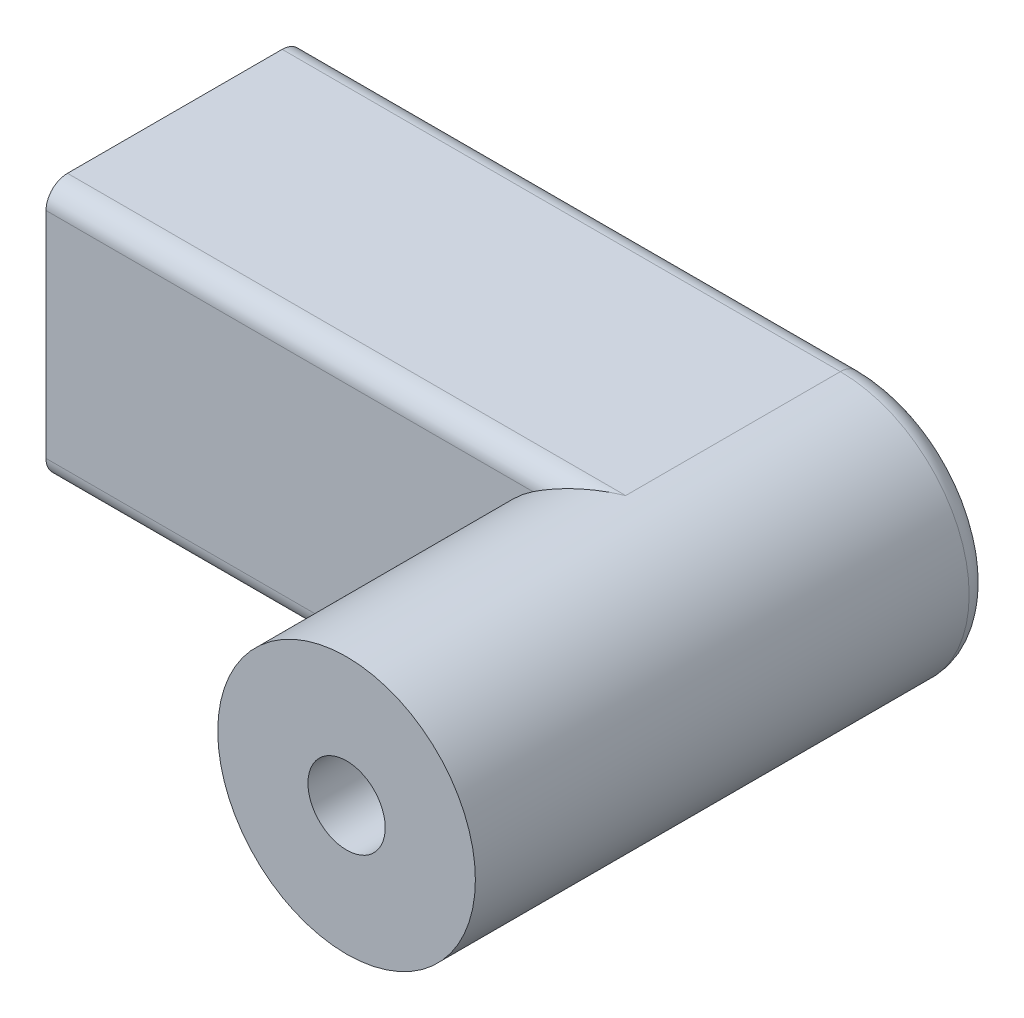
ISO-10303-21;
HEADER;
FILE_DESCRIPTION(('STEP AP214'),'2;1');
FILE_NAME('part.step','',(''),(''),'','','');
FILE_SCHEMA(('AUTOMOTIVE_DESIGN { 1 0 10303 214 1 1 1 1 }'));
ENDSEC;
DATA;
#1=APPLICATION_CONTEXT('core data for automotive mechanical design processes');
#2=APPLICATION_PROTOCOL_DEFINITION('international standard','automotive_design',2000,#1);
#3=PRODUCT_CONTEXT('',#1,'mechanical');
#4=PRODUCT('Part','Part','',(#3));
#5=PRODUCT_RELATED_PRODUCT_CATEGORY('part','',(#4));
#6=PRODUCT_DEFINITION_FORMATION('','',#4);
#7=PRODUCT_DEFINITION_CONTEXT('part definition',#1,'design');
#8=PRODUCT_DEFINITION('design','',#6,#7);
#9=PRODUCT_DEFINITION_SHAPE('','',#8);
#10=(LENGTH_UNIT() NAMED_UNIT(*) SI_UNIT(.MILLI.,.METRE.));
#11=(NAMED_UNIT(*) PLANE_ANGLE_UNIT() SI_UNIT($,.RADIAN.));
#12=(NAMED_UNIT(*) SI_UNIT($,.STERADIAN.) SOLID_ANGLE_UNIT());
#13=UNCERTAINTY_MEASURE_WITH_UNIT(LENGTH_MEASURE(1.E-05),#10,'distance_accuracy_value','');
#14=(GEOMETRIC_REPRESENTATION_CONTEXT(3) GLOBAL_UNCERTAINTY_ASSIGNED_CONTEXT((#13)) GLOBAL_UNIT_ASSIGNED_CONTEXT((#10,
#11,#12)) REPRESENTATION_CONTEXT('',''));
#15=CARTESIAN_POINT('',(0.,0.,0.));
#16=DIRECTION('',(0.,0.,1.));
#17=DIRECTION('',(1.,0.,0.));
#18=AXIS2_PLACEMENT_3D('',#15,#16,#17);
#19=CARTESIAN_POINT('',(0.,0.,6.));
#20=DIRECTION('',(0.,0.,1.));
#21=DIRECTION('',(0.,-1.,0.));
#22=AXIS2_PLACEMENT_3D('',#19,#20,#21);
#23=PLANE('',#22);
#24=CARTESIAN_POINT('',(0.,0.,6.));
#25=DIRECTION('',(0.,0.,1.));
#26=DIRECTION('',(0.,-1.,0.));
#27=AXIS2_PLACEMENT_3D('',#24,#25,#26);
#28=CIRCLE('',#27,3.);
#29=CARTESIAN_POINT('',(0.,-3.,6.));
#30=VERTEX_POINT('',#29);
#31=EDGE_CURVE('E223',#30,#30,#28,.T.);
#32=ORIENTED_EDGE('',*,*,#31,.T.);
#33=EDGE_LOOP('',(#32));
#34=FACE_BOUND('',#33,.T.);
#35=CARTESIAN_POINT('',(0.,0.,6.));
#36=DIRECTION('',(0.,0.,1.));
#37=DIRECTION('',(0.,-1.,0.));
#38=AXIS2_PLACEMENT_3D('',#35,#36,#37);
#39=CIRCLE('',#38,0.9);
#40=CARTESIAN_POINT('',(0.,-0.899999999999999,6.));
#41=VERTEX_POINT('',#40);
#42=EDGE_CURVE('E219',#41,#41,#39,.T.);
#43=ORIENTED_EDGE('',*,*,#42,.F.);
#44=EDGE_LOOP('',(#43));
#45=FACE_BOUND('',#44,.T.);
#46=ADVANCED_FACE('F46',(#34,#45),#23,.T.);
#47=CARTESIAN_POINT('',(0.,0.,-6.));
#48=DIRECTION('',(0.,0.,1.));
#49=DIRECTION('',(0.,-1.,0.));
#50=AXIS2_PLACEMENT_3D('',#47,#48,#49);
#51=PLANE('',#50);
#52=CARTESIAN_POINT('',(0.,0.,-6.));
#53=DIRECTION('',(0.,0.,1.));
#54=DIRECTION('',(0.,-1.,0.));
#55=AXIS2_PLACEMENT_3D('',#52,#53,#54);
#56=CIRCLE('',#55,2.5);
#57=CARTESIAN_POINT('',(0.,2.5,-6.));
#58=VERTEX_POINT('',#57);
#59=CARTESIAN_POINT('',(0.,-2.5,-6.));
#60=VERTEX_POINT('',#59);
#61=EDGE_CURVE('E237',#58,#60,#56,.F.);
#62=ORIENTED_EDGE('',*,*,#61,.T.);
#63=DIRECTION('',(1.,0.,0.));
#64=VECTOR('',#63,1.);
#65=CARTESIAN_POINT('',(0.,-2.5,-6.));
#66=LINE('',#65,#64);
#67=CARTESIAN_POINT('',(-13.,-2.5,-6.));
#68=VERTEX_POINT('',#67);
#69=EDGE_CURVE('E240',#60,#68,#66,.F.);
#70=ORIENTED_EDGE('',*,*,#69,.T.);
#71=DIRECTION('',(0.,-1.,0.));
#72=VECTOR('',#71,1.);
#73=CARTESIAN_POINT('',(-13.,3.,-6.));
#74=LINE('',#73,#72);
#75=CARTESIAN_POINT('',(-13.,2.5,-6.));
#76=VERTEX_POINT('',#75);
#77=EDGE_CURVE('E214',#76,#68,#74,.T.);
#78=ORIENTED_EDGE('',*,*,#77,.F.);
#79=DIRECTION('',(1.,0.,0.));
#80=VECTOR('',#79,1.);
#81=CARTESIAN_POINT('',(0.,2.5,-6.));
#82=LINE('',#81,#80);
#83=EDGE_CURVE('E234',#76,#58,#82,.T.);
#84=ORIENTED_EDGE('',*,*,#83,.T.);
#85=EDGE_LOOP('',(#62,#70,#78,#84));
#86=FACE_BOUND('',#85,.T.);
#87=CARTESIAN_POINT('',(0.,0.,-6.));
#88=DIRECTION('',(0.,0.,1.));
#89=DIRECTION('',(0.,-1.,0.));
#90=AXIS2_PLACEMENT_3D('',#87,#88,#89);
#91=CIRCLE('',#90,0.9);
#92=CARTESIAN_POINT('',(0.,-0.900000000000001,-6.));
#93=VERTEX_POINT('',#92);
#94=EDGE_CURVE('E218',#93,#93,#91,.T.);
#95=ORIENTED_EDGE('',*,*,#94,.T.);
#96=EDGE_LOOP('',(#95));
#97=FACE_BOUND('',#96,.T.);
#98=ADVANCED_FACE('F300',(#86,#97),#51,.F.);
#99=CARTESIAN_POINT('',(0.,0.,6.));
#100=DIRECTION('',(0.,0.,-1.));
#101=DIRECTION('',(0.,1.,0.));
#102=AXIS2_PLACEMENT_3D('',#99,#100,#101);
#103=CYLINDRICAL_SURFACE('',#102,3.);
#104=ORIENTED_EDGE('',*,*,#31,.F.);
#105=EDGE_LOOP('',(#104));
#106=FACE_BOUND('',#105,.T.);
#107=DIRECTION('',(0.,0.,-1.));
#108=VECTOR('',#107,1.);
#109=CARTESIAN_POINT('',(0.,-3.,6.));
#110=LINE('',#109,#108);
#111=CARTESIAN_POINT('',(0.,-3.,-5.5));
#112=VERTEX_POINT('',#111);
#113=CARTESIAN_POINT('',(0.,-3.,-0.5));
#114=VERTEX_POINT('',#113);
#115=EDGE_CURVE('E194',#112,#114,#110,.F.);
#116=ORIENTED_EDGE('',*,*,#115,.F.);
#117=CARTESIAN_POINT('',(0.,0.,-5.5));
#118=DIRECTION('',(0.,0.,1.));
#119=DIRECTION('',(0.,-1.,0.));
#120=AXIS2_PLACEMENT_3D('',#117,#118,#119);
#121=CIRCLE('',#120,3.);
#122=CARTESIAN_POINT('',(0.,3.,-5.5));
#123=VERTEX_POINT('',#122);
#124=EDGE_CURVE('E230',#112,#123,#121,.T.);
#125=ORIENTED_EDGE('',*,*,#124,.T.);
#126=DIRECTION('',(0.,0.,-1.));
#127=VECTOR('',#126,1.);
#128=CARTESIAN_POINT('',(0.,3.,6.));
#129=LINE('',#128,#127);
#130=CARTESIAN_POINT('',(0.,3.,-0.5));
#131=VERTEX_POINT('',#130);
#132=EDGE_CURVE('E184',#123,#131,#129,.F.);
#133=ORIENTED_EDGE('',*,*,#132,.T.);
#134=CARTESIAN_POINT('',(-1.6583123951777,2.5,0.));
#135=CARTESIAN_POINT('',(-1.62294442389626,2.5234654934639,-1.95507206975599E-05));
#136=CARTESIAN_POINT('',(-1.58710499265372,2.54615299134875,-0.00164994916894755));
#137=CARTESIAN_POINT('',(-1.51472138396971,2.58986425514904,-0.00764358737440156));
#138=CARTESIAN_POINT('',(-1.47817843136526,2.61089063561975,-0.0120024320587876));
#139=CARTESIAN_POINT('',(-1.40470504629449,2.65114156465537,-0.022938424672973));
#140=CARTESIAN_POINT('',(-1.36777766630945,2.67037501582419,-0.0295037741057903));
#141=CARTESIAN_POINT('',(-1.29344685593278,2.70716011125678,-0.0445009621293465));
#142=CARTESIAN_POINT('',(-1.25604315650892,2.72471075255046,-0.052933904034741));
#143=CARTESIAN_POINT('',(-1.15052852760255,2.77160739186769,-0.078788001109604));
#144=CARTESIAN_POINT('',(-1.08199171317208,2.7990447861906,-0.0979713651124975));
#145=CARTESIAN_POINT('',(-0.944114314919654,2.84851170917893,-0.140011190340652));
#146=CARTESIAN_POINT('',(-0.874773364195539,2.87053865868494,-0.162869394805722));
#147=CARTESIAN_POINT('',(-0.665524946967841,2.92883784949406,-0.235486162195037));
#148=CARTESIAN_POINT('',(-0.524727164761933,2.9571819210025,-0.289194181711027));
#149=CARTESIAN_POINT('',(-0.259249953486023,2.9914036055076,-0.394205237294453));
#150=CARTESIAN_POINT('',(-0.13465626591283,2.99956232429863,-0.445027957113722));
#151=CARTESIAN_POINT('',(-0.00676117999003824,2.99999427491286,-0.497239759046843));
#152=CARTESIAN_POINT('',(-0.00338055702080258,2.99999998838658,-0.498619892704301));
#153=CARTESIAN_POINT('',(0.,3.,-0.5));
#154=B_SPLINE_CURVE_WITH_KNOTS('',3,(#134,#135,#136,#137,#138,#139,#140,#141,#142,#143,#144,
#145,#146,#147,#148,#149,#150,#151,#152,#153),.UNSPECIFIED.,.F.,.F.,(4,2,2,2,2,2,2,2,2,4),(0.,
0.127240004662348,0.254275572444974,0.380642393218094,0.507084067611572,0.73554595909279,
0.964116547928085,1.42237712040049,1.8258427134639,1.83679717802781),.UNSPECIFIED.);
#155=CARTESIAN_POINT('',(-1.6583123951777,2.5,0.));
#156=VERTEX_POINT('',#155);
#157=EDGE_CURVE('E275',#131,#156,#154,.F.);
#158=ORIENTED_EDGE('',*,*,#157,.T.);
#159=CARTESIAN_POINT('',(0.,0.,0.));
#160=DIRECTION('',(0.,0.,1.));
#161=DIRECTION('',(0.,-1.,0.));
#162=AXIS2_PLACEMENT_3D('',#159,#160,#161);
#163=CIRCLE('',#162,3.);
#164=CARTESIAN_POINT('',(-1.6583123951777,-2.5,0.));
#165=VERTEX_POINT('',#164);
#166=EDGE_CURVE('E195',#165,#156,#163,.F.);
#167=ORIENTED_EDGE('',*,*,#166,.F.);
#168=CARTESIAN_POINT('',(-1.6583123951777,-2.5,0.));
#169=CARTESIAN_POINT('',(-1.62294442389626,-2.5234654934639,-1.95507206975862E-05));
#170=CARTESIAN_POINT('',(-1.58710499265371,-2.54615299134875,-0.0016499491689479));
#171=CARTESIAN_POINT('',(-1.51472138396969,-2.58986425514904,-0.00764358737440296));
#172=CARTESIAN_POINT('',(-1.47817843136524,-2.61089063561976,-0.0120024320587897));
#173=CARTESIAN_POINT('',(-1.40470504629447,-2.65114156465538,-0.0229384246729759));
#174=CARTESIAN_POINT('',(-1.36777766630944,-2.6703750158242,-0.0295037741057929));
#175=CARTESIAN_POINT('',(-1.29344685593278,-2.70716011125679,-0.0445009621293478));
#176=CARTESIAN_POINT('',(-1.25604315650892,-2.72471075255047,-0.0529339040347412));
#177=CARTESIAN_POINT('',(-1.15052852760255,-2.77160739186769,-0.0787880011096044));
#178=CARTESIAN_POINT('',(-1.08199171317208,-2.7990447861906,-0.0979713651125009));
#179=CARTESIAN_POINT('',(-0.944114314919657,-2.84851170917893,-0.140011190340647));
#180=CARTESIAN_POINT('',(-0.874773364195541,-2.87053865868494,-0.162869394805705));
#181=CARTESIAN_POINT('',(-0.665524946967859,-2.92883784949406,-0.235486162195067));
#182=CARTESIAN_POINT('',(-0.524727164762002,-2.9571819210025,-0.289194181711196));
#183=CARTESIAN_POINT('',(-0.259249953485957,-2.99140360550761,-0.394205237294302));
#184=CARTESIAN_POINT('',(-0.134656265912607,-2.99956232429863,-0.445027957113182));
#185=CARTESIAN_POINT('',(-0.00676117999002619,-2.99999427491286,-0.497239759046814));
#186=CARTESIAN_POINT('',(-0.00338055702079642,-2.99999998838658,-0.498619892704286));
#187=CARTESIAN_POINT('',(0.,-3.,-0.5));
#188=B_SPLINE_CURVE_WITH_KNOTS('',3,(#168,#169,#170,#171,#172,#173,#174,#175,#176,#177,#178,
#179,#180,#181,#182,#183,#184,#185,#186,#187),.UNSPECIFIED.,.F.,.F.,(4,2,2,2,2,2,2,2,2,4),(0.,
0.127240004662359,0.254275572444993,0.380642393218104,0.507084067611572,0.735545959092786,
0.964116547928073,1.42237712040049,1.8258427134639,1.83679717802781),.UNSPECIFIED.);
#189=EDGE_CURVE('E284',#165,#114,#188,.T.);
#190=ORIENTED_EDGE('',*,*,#189,.T.);
#191=EDGE_LOOP('',(#116,#125,#133,#158,#167,#190));
#192=FACE_BOUND('',#191,.T.);
#193=ADVANCED_FACE('F294',(#106,#192),#103,.T.);
#194=CARTESIAN_POINT('',(0.,0.,6.));
#195=DIRECTION('',(0.,0.,-1.));
#196=DIRECTION('',(0.,1.,0.));
#197=AXIS2_PLACEMENT_3D('',#194,#195,#196);
#198=CYLINDRICAL_SURFACE('',#197,0.9);
#199=ORIENTED_EDGE('',*,*,#42,.T.);
#200=EDGE_LOOP('',(#199));
#201=FACE_BOUND('',#200,.T.);
#202=ORIENTED_EDGE('',*,*,#94,.F.);
#203=EDGE_LOOP('',(#202));
#204=FACE_BOUND('',#203,.T.);
#205=ADVANCED_FACE('F299',(#201,#204),#198,.F.);
#206=CARTESIAN_POINT('',(-13.,-3.,-6.));
#207=DIRECTION('',(0.,1.,0.));
#208=DIRECTION('',(-1.,0.,0.));
#209=AXIS2_PLACEMENT_3D('',#206,#207,#208);
#210=PLANE('',#209);
#211=DIRECTION('',(0.,0.,1.));
#212=VECTOR('',#211,1.);
#213=CARTESIAN_POINT('',(-13.,-3.,-6.));
#214=LINE('',#213,#212);
#215=CARTESIAN_POINT('',(-13.,-3.,-5.5));
#216=VERTEX_POINT('',#215);
#217=CARTESIAN_POINT('',(-13.,-3.,-0.5));
#218=VERTEX_POINT('',#217);
#219=EDGE_CURVE('E199',#216,#218,#214,.T.);
#220=ORIENTED_EDGE('',*,*,#219,.F.);
#221=DIRECTION('',(1.,0.,0.));
#222=VECTOR('',#221,1.);
#223=CARTESIAN_POINT('',(-13.,-3.,-5.5));
#224=LINE('',#223,#222);
#225=EDGE_CURVE('E246',#216,#112,#224,.T.);
#226=ORIENTED_EDGE('',*,*,#225,.T.);
#227=ORIENTED_EDGE('',*,*,#115,.T.);
#228=DIRECTION('',(1.,0.,0.));
#229=VECTOR('',#228,1.);
#230=CARTESIAN_POINT('',(-13.,-3.,-0.5));
#231=LINE('',#230,#229);
#232=EDGE_CURVE('E243',#114,#218,#231,.F.);
#233=ORIENTED_EDGE('',*,*,#232,.T.);
#234=EDGE_LOOP('',(#220,#226,#227,#233));
#235=FACE_BOUND('',#234,.T.);
#236=ADVANCED_FACE('F329',(#235),#210,.F.);
#237=CARTESIAN_POINT('',(-13.,3.,0.));
#238=DIRECTION('',(0.,0.,-1.));
#239=DIRECTION('',(0.,1.,0.));
#240=AXIS2_PLACEMENT_3D('',#237,#238,#239);
#241=PLANE('',#240);
#242=ORIENTED_EDGE('',*,*,#166,.T.);
#243=DIRECTION('',(1.,0.,0.));
#244=VECTOR('',#243,1.);
#245=CARTESIAN_POINT('',(-13.,2.5,0.));
#246=LINE('',#245,#244);
#247=CARTESIAN_POINT('',(-13.,2.5,0.));
#248=VERTEX_POINT('',#247);
#249=EDGE_CURVE('E272',#156,#248,#246,.F.);
#250=ORIENTED_EDGE('',*,*,#249,.T.);
#251=DIRECTION('',(0.,1.,0.));
#252=VECTOR('',#251,1.);
#253=CARTESIAN_POINT('',(-13.,3.,0.));
#254=LINE('',#253,#252);
#255=CARTESIAN_POINT('',(-13.,-2.5,0.));
#256=VERTEX_POINT('',#255);
#257=EDGE_CURVE('E206',#256,#248,#254,.T.);
#258=ORIENTED_EDGE('',*,*,#257,.F.);
#259=DIRECTION('',(1.,0.,0.));
#260=VECTOR('',#259,1.);
#261=CARTESIAN_POINT('',(-13.,-2.5,0.));
#262=LINE('',#261,#260);
#263=EDGE_CURVE('E268',#256,#165,#262,.T.);
#264=ORIENTED_EDGE('',*,*,#263,.T.);
#265=EDGE_LOOP('',(#242,#250,#258,#264));
#266=FACE_BOUND('',#265,.T.);
#267=ADVANCED_FACE('F333',(#266),#241,.F.);
#268=CARTESIAN_POINT('',(-13.,3.,-6.));
#269=DIRECTION('',(0.,-1.,0.));
#270=DIRECTION('',(1.,0.,0.));
#271=AXIS2_PLACEMENT_3D('',#268,#269,#270);
#272=PLANE('',#271);
#273=ORIENTED_EDGE('',*,*,#132,.F.);
#274=DIRECTION('',(1.,0.,0.));
#275=VECTOR('',#274,1.);
#276=CARTESIAN_POINT('',(-13.,3.,-5.5));
#277=LINE('',#276,#275);
#278=CARTESIAN_POINT('',(-13.,3.,-5.5));
#279=VERTEX_POINT('',#278);
#280=EDGE_CURVE('E265',#123,#279,#277,.F.);
#281=ORIENTED_EDGE('',*,*,#280,.T.);
#282=DIRECTION('',(0.,0.,-1.));
#283=VECTOR('',#282,1.);
#284=CARTESIAN_POINT('',(-13.,3.,-6.));
#285=LINE('',#284,#283);
#286=CARTESIAN_POINT('',(-13.,3.,-0.5));
#287=VERTEX_POINT('',#286);
#288=EDGE_CURVE('E210',#287,#279,#285,.T.);
#289=ORIENTED_EDGE('',*,*,#288,.F.);
#290=DIRECTION('',(1.,0.,0.));
#291=VECTOR('',#290,1.);
#292=CARTESIAN_POINT('',(-13.,3.,-0.5));
#293=LINE('',#292,#291);
#294=EDGE_CURVE('E261',#287,#131,#293,.T.);
#295=ORIENTED_EDGE('',*,*,#294,.T.);
#296=EDGE_LOOP('',(#273,#281,#289,#295));
#297=FACE_BOUND('',#296,.T.);
#298=ADVANCED_FACE('F337',(#297),#272,.F.);
#299=CARTESIAN_POINT('',(-13.,0.,-6.));
#300=DIRECTION('',(1.,0.,0.));
#301=DIRECTION('',(0.,1.,0.));
#302=AXIS2_PLACEMENT_3D('',#299,#300,#301);
#303=PLANE('',#302);
#304=DIRECTION('',(0.,0.,-1.));
#305=VECTOR('',#304,1.);
#306=CARTESIAN_POINT('',(-13.,-2.1,-6.));
#307=LINE('',#306,#305);
#308=CARTESIAN_POINT('',(-13.,-2.1,-0.9));
#309=VERTEX_POINT('',#308);
#310=CARTESIAN_POINT('',(-13.,-2.1,-5.1));
#311=VERTEX_POINT('',#310);
#312=EDGE_CURVE('E388',#309,#311,#307,.T.);
#313=ORIENTED_EDGE('',*,*,#312,.T.);
#314=DIRECTION('',(0.,1.,0.));
#315=VECTOR('',#314,1.);
#316=CARTESIAN_POINT('',(-13.,0.,-5.1));
#317=LINE('',#316,#315);
#318=CARTESIAN_POINT('',(-13.,2.1,-5.1));
#319=VERTEX_POINT('',#318);
#320=EDGE_CURVE('E391',#311,#319,#317,.T.);
#321=ORIENTED_EDGE('',*,*,#320,.T.);
#322=DIRECTION('',(0.,0.,1.));
#323=VECTOR('',#322,1.);
#324=CARTESIAN_POINT('',(-13.,2.1,-6.));
#325=LINE('',#324,#323);
#326=CARTESIAN_POINT('',(-13.,2.1,-0.9));
#327=VERTEX_POINT('',#326);
#328=EDGE_CURVE('E369',#319,#327,#325,.T.);
#329=ORIENTED_EDGE('',*,*,#328,.T.);
#330=DIRECTION('',(0.,-1.,0.));
#331=VECTOR('',#330,1.);
#332=CARTESIAN_POINT('',(-13.,0.,-0.9));
#333=LINE('',#332,#331);
#334=EDGE_CURVE('E383',#327,#309,#333,.T.);
#335=ORIENTED_EDGE('',*,*,#334,.T.);
#336=EDGE_LOOP('',(#313,#321,#329,#335));
#337=FACE_BOUND('',#336,.T.);
#338=ORIENTED_EDGE('',*,*,#77,.T.);
#339=CARTESIAN_POINT('',(-13.,-2.5,-5.5));
#340=DIRECTION('',(1.,0.,0.));
#341=DIRECTION('',(0.,1.,0.));
#342=AXIS2_PLACEMENT_3D('',#339,#340,#341);
#343=CIRCLE('',#342,0.5);
#344=EDGE_CURVE('E258',#68,#216,#343,.F.);
#345=ORIENTED_EDGE('',*,*,#344,.T.);
#346=ORIENTED_EDGE('',*,*,#219,.T.);
#347=CARTESIAN_POINT('',(-13.,-2.5,-0.5));
#348=DIRECTION('',(1.,0.,0.));
#349=DIRECTION('',(0.,1.,0.));
#350=AXIS2_PLACEMENT_3D('',#347,#348,#349);
#351=CIRCLE('',#350,0.5);
#352=EDGE_CURVE('E249',#218,#256,#351,.F.);
#353=ORIENTED_EDGE('',*,*,#352,.T.);
#354=ORIENTED_EDGE('',*,*,#257,.T.);
#355=CARTESIAN_POINT('',(-13.,2.5,-0.5));
#356=DIRECTION('',(1.,0.,0.));
#357=DIRECTION('',(0.,1.,0.));
#358=AXIS2_PLACEMENT_3D('',#355,#356,#357);
#359=CIRCLE('',#358,0.5);
#360=EDGE_CURVE('E252',#248,#287,#359,.F.);
#361=ORIENTED_EDGE('',*,*,#360,.T.);
#362=ORIENTED_EDGE('',*,*,#288,.T.);
#363=CARTESIAN_POINT('',(-13.,2.5,-5.5));
#364=DIRECTION('',(1.,0.,0.));
#365=DIRECTION('',(0.,1.,0.));
#366=AXIS2_PLACEMENT_3D('',#363,#364,#365);
#367=CIRCLE('',#366,0.5);
#368=EDGE_CURVE('E255',#279,#76,#367,.F.);
#369=ORIENTED_EDGE('',*,*,#368,.T.);
#370=EDGE_LOOP('',(#338,#345,#346,#353,#354,#361,#362,#369));
#371=FACE_BOUND('',#370,.T.);
#372=ADVANCED_FACE('F341',(#337,#371),#303,.F.);
#373=CARTESIAN_POINT('',(-3.,-1.6,-4.6));
#374=DIRECTION('',(0.,-1.,0.));
#375=DIRECTION('',(1.,0.,0.));
#376=AXIS2_PLACEMENT_3D('',#373,#374,#375);
#377=PLANE('',#376);
#378=DIRECTION('',(-1.,0.,0.));
#379=VECTOR('',#378,1.);
#380=CARTESIAN_POINT('',(-3.,-1.6,-4.6));
#381=LINE('',#380,#379);
#382=CARTESIAN_POINT('',(-3.,-1.6,-4.6));
#383=VERTEX_POINT('',#382);
#384=CARTESIAN_POINT('',(-12.5,-1.6,-4.6));
#385=VERTEX_POINT('',#384);
#386=EDGE_CURVE('E181',#383,#385,#381,.T.);
#387=ORIENTED_EDGE('',*,*,#386,.T.);
#388=DIRECTION('',(0.,0.,1.));
#389=VECTOR('',#388,1.);
#390=CARTESIAN_POINT('',(-12.5,-1.6,-4.6));
#391=LINE('',#390,#389);
#392=CARTESIAN_POINT('',(-12.5,-1.6,-1.4));
#393=VERTEX_POINT('',#392);
#394=EDGE_CURVE('E72',#385,#393,#391,.T.);
#395=ORIENTED_EDGE('',*,*,#394,.T.);
#396=DIRECTION('',(-1.,0.,0.));
#397=VECTOR('',#396,1.);
#398=CARTESIAN_POINT('',(-3.,-1.6,-1.4));
#399=LINE('',#398,#397);
#400=CARTESIAN_POINT('',(-3.,-1.6,-1.4));
#401=VERTEX_POINT('',#400);
#402=EDGE_CURVE('E148',#401,#393,#399,.T.);
#403=ORIENTED_EDGE('',*,*,#402,.F.);
#404=DIRECTION('',(0.,0.,1.));
#405=VECTOR('',#404,1.);
#406=CARTESIAN_POINT('',(-3.,-1.6,-4.6));
#407=LINE('',#406,#405);
#408=EDGE_CURVE('E152',#383,#401,#407,.T.);
#409=ORIENTED_EDGE('',*,*,#408,.F.);
#410=EDGE_LOOP('',(#387,#395,#403,#409));
#411=FACE_BOUND('',#410,.T.);
#412=ADVANCED_FACE('F150',(#411),#377,.F.);
#413=CARTESIAN_POINT('',(-3.,1.6,-4.6));
#414=DIRECTION('',(0.,0.,-1.));
#415=DIRECTION('',(0.,1.,0.));
#416=AXIS2_PLACEMENT_3D('',#413,#414,#415);
#417=PLANE('',#416);
#418=DIRECTION('',(-1.,0.,0.));
#419=VECTOR('',#418,1.);
#420=CARTESIAN_POINT('',(-3.,1.6,-4.6));
#421=LINE('',#420,#419);
#422=CARTESIAN_POINT('',(-3.,1.6,-4.6));
#423=VERTEX_POINT('',#422);
#424=CARTESIAN_POINT('',(-12.5,1.6,-4.6));
#425=VERTEX_POINT('',#424);
#426=EDGE_CURVE('E185',#423,#425,#421,.T.);
#427=ORIENTED_EDGE('',*,*,#426,.T.);
#428=DIRECTION('',(0.,-1.,0.));
#429=VECTOR('',#428,1.);
#430=CARTESIAN_POINT('',(-12.5,1.6,-4.6));
#431=LINE('',#430,#429);
#432=EDGE_CURVE('E362',#425,#385,#431,.T.);
#433=ORIENTED_EDGE('',*,*,#432,.T.);
#434=ORIENTED_EDGE('',*,*,#386,.F.);
#435=DIRECTION('',(0.,-1.,0.));
#436=VECTOR('',#435,1.);
#437=CARTESIAN_POINT('',(-3.,1.6,-4.6));
#438=LINE('',#437,#436);
#439=EDGE_CURVE('E156',#423,#383,#438,.T.);
#440=ORIENTED_EDGE('',*,*,#439,.F.);
#441=EDGE_LOOP('',(#427,#433,#434,#440));
#442=FACE_BOUND('',#441,.T.);
#443=ADVANCED_FACE('F348',(#442),#417,.F.);
#444=CARTESIAN_POINT('',(-3.,1.6,-4.6));
#445=DIRECTION('',(0.,1.,0.));
#446=DIRECTION('',(-1.,0.,0.));
#447=AXIS2_PLACEMENT_3D('',#444,#445,#446);
#448=PLANE('',#447);
#449=DIRECTION('',(-1.,0.,0.));
#450=VECTOR('',#449,1.);
#451=CARTESIAN_POINT('',(-3.,1.6,-1.4));
#452=LINE('',#451,#450);
#453=CARTESIAN_POINT('',(-3.,1.6,-1.4));
#454=VERTEX_POINT('',#453);
#455=CARTESIAN_POINT('',(-12.5,1.6,-1.4));
#456=VERTEX_POINT('',#455);
#457=EDGE_CURVE('E155',#454,#456,#452,.T.);
#458=ORIENTED_EDGE('',*,*,#457,.T.);
#459=DIRECTION('',(0.,0.,-1.));
#460=VECTOR('',#459,1.);
#461=CARTESIAN_POINT('',(-12.5,1.6,-4.6));
#462=LINE('',#461,#460);
#463=EDGE_CURVE('E11',#456,#425,#462,.T.);
#464=ORIENTED_EDGE('',*,*,#463,.T.);
#465=ORIENTED_EDGE('',*,*,#426,.F.);
#466=DIRECTION('',(0.,0.,-1.));
#467=VECTOR('',#466,1.);
#468=CARTESIAN_POINT('',(-3.,1.6,-4.6));
#469=LINE('',#468,#467);
#470=EDGE_CURVE('E165',#454,#423,#469,.T.);
#471=ORIENTED_EDGE('',*,*,#470,.F.);
#472=EDGE_LOOP('',(#458,#464,#465,#471));
#473=FACE_BOUND('',#472,.T.);
#474=ADVANCED_FACE('F351',(#473),#448,.F.);
#475=CARTESIAN_POINT('',(-3.,1.6,-1.4));
#476=DIRECTION('',(0.,0.,1.));
#477=DIRECTION('',(0.,-1.,0.));
#478=AXIS2_PLACEMENT_3D('',#475,#476,#477);
#479=PLANE('',#478);
#480=ORIENTED_EDGE('',*,*,#402,.T.);
#481=DIRECTION('',(0.,1.,0.));
#482=VECTOR('',#481,1.);
#483=CARTESIAN_POINT('',(-12.5,1.6,-1.4));
#484=LINE('',#483,#482);
#485=EDGE_CURVE('E57',#393,#456,#484,.T.);
#486=ORIENTED_EDGE('',*,*,#485,.T.);
#487=ORIENTED_EDGE('',*,*,#457,.F.);
#488=DIRECTION('',(0.,1.,0.));
#489=VECTOR('',#488,1.);
#490=CARTESIAN_POINT('',(-3.,1.6,-1.4));
#491=LINE('',#490,#489);
#492=EDGE_CURVE('E159',#401,#454,#491,.T.);
#493=ORIENTED_EDGE('',*,*,#492,.F.);
#494=EDGE_LOOP('',(#480,#486,#487,#493));
#495=FACE_BOUND('',#494,.T.);
#496=ADVANCED_FACE('F160',(#495),#479,.F.);
#497=CARTESIAN_POINT('',(-3.,0.,-6.));
#498=DIRECTION('',(1.,0.,0.));
#499=DIRECTION('',(0.,1.,0.));
#500=AXIS2_PLACEMENT_3D('',#497,#498,#499);
#501=PLANE('',#500);
#502=ORIENTED_EDGE('',*,*,#408,.T.);
#503=ORIENTED_EDGE('',*,*,#492,.T.);
#504=ORIENTED_EDGE('',*,*,#470,.T.);
#505=ORIENTED_EDGE('',*,*,#439,.T.);
#506=EDGE_LOOP('',(#502,#503,#504,#505));
#507=FACE_BOUND('',#506,.T.);
#508=ADVANCED_FACE('F167',(#507),#501,.F.);
#509=CARTESIAN_POINT('',(-13.,-2.5,-5.5));
#510=DIRECTION('',(1.,0.,0.));
#511=DIRECTION('',(0.,1.,0.));
#512=AXIS2_PLACEMENT_3D('',#509,#510,#511);
#513=CYLINDRICAL_SURFACE('',#512,0.5);
#514=ORIENTED_EDGE('',*,*,#344,.F.);
#515=ORIENTED_EDGE('',*,*,#69,.F.);
#516=CARTESIAN_POINT('',(0.,-2.5,-5.5));
#517=DIRECTION('',(1.,0.,0.));
#518=DIRECTION('',(0.,1.,0.));
#519=AXIS2_PLACEMENT_3D('',#516,#517,#518);
#520=CIRCLE('',#519,0.5);
#521=EDGE_CURVE('E170',#112,#60,#520,.T.);
#522=ORIENTED_EDGE('',*,*,#521,.F.);
#523=ORIENTED_EDGE('',*,*,#225,.F.);
#524=EDGE_LOOP('',(#514,#515,#522,#523));
#525=FACE_BOUND('',#524,.T.);
#526=ADVANCED_FACE('F310',(#525),#513,.T.);
#527=CARTESIAN_POINT('',(0.,2.5,-5.5));
#528=DIRECTION('',(1.,0.,0.));
#529=DIRECTION('',(0.,1.,0.));
#530=AXIS2_PLACEMENT_3D('',#527,#528,#529);
#531=CYLINDRICAL_SURFACE('',#530,0.5);
#532=ORIENTED_EDGE('',*,*,#368,.F.);
#533=ORIENTED_EDGE('',*,*,#280,.F.);
#534=CARTESIAN_POINT('',(0.,2.5,-5.5));
#535=DIRECTION('',(1.,0.,0.));
#536=DIRECTION('',(0.,1.,0.));
#537=AXIS2_PLACEMENT_3D('',#534,#535,#536);
#538=CIRCLE('',#537,0.5);
#539=EDGE_CURVE('E174',#58,#123,#538,.T.);
#540=ORIENTED_EDGE('',*,*,#539,.F.);
#541=ORIENTED_EDGE('',*,*,#83,.F.);
#542=EDGE_LOOP('',(#532,#533,#540,#541));
#543=FACE_BOUND('',#542,.T.);
#544=ADVANCED_FACE('F307',(#543),#531,.T.);
#545=CARTESIAN_POINT('',(0.,0.,-5.5));
#546=DIRECTION('',(0.,0.,1.));
#547=DIRECTION('',(0.,-1.,0.));
#548=AXIS2_PLACEMENT_3D('',#545,#546,#547);
#549=TOROIDAL_SURFACE('',#548,2.5,0.5);
#550=ORIENTED_EDGE('',*,*,#521,.T.);
#551=ORIENTED_EDGE('',*,*,#61,.F.);
#552=ORIENTED_EDGE('',*,*,#539,.T.);
#553=ORIENTED_EDGE('',*,*,#124,.F.);
#554=EDGE_LOOP('',(#550,#551,#552,#553));
#555=FACE_BOUND('',#554,.T.);
#556=ADVANCED_FACE('F303',(#555),#549,.T.);
#557=CARTESIAN_POINT('',(-13.,2.5,-0.5));
#558=DIRECTION('',(1.,0.,0.));
#559=DIRECTION('',(0.,1.,0.));
#560=AXIS2_PLACEMENT_3D('',#557,#558,#559);
#561=CYLINDRICAL_SURFACE('',#560,0.5);
#562=ORIENTED_EDGE('',*,*,#360,.F.);
#563=ORIENTED_EDGE('',*,*,#249,.F.);
#564=ORIENTED_EDGE('',*,*,#157,.F.);
#565=ORIENTED_EDGE('',*,*,#294,.F.);
#566=EDGE_LOOP('',(#562,#563,#564,#565));
#567=FACE_BOUND('',#566,.T.);
#568=ADVANCED_FACE('F291',(#567),#561,.T.);
#569=CARTESIAN_POINT('',(-13.,-2.5,-0.5));
#570=DIRECTION('',(1.,0.,0.));
#571=DIRECTION('',(0.,1.,0.));
#572=AXIS2_PLACEMENT_3D('',#569,#570,#571);
#573=CYLINDRICAL_SURFACE('',#572,0.5);
#574=ORIENTED_EDGE('',*,*,#352,.F.);
#575=ORIENTED_EDGE('',*,*,#232,.F.);
#576=ORIENTED_EDGE('',*,*,#189,.F.);
#577=ORIENTED_EDGE('',*,*,#263,.F.);
#578=EDGE_LOOP('',(#574,#575,#576,#577));
#579=FACE_BOUND('',#578,.T.);
#580=ADVANCED_FACE('F427',(#579),#573,.T.);
#581=CARTESIAN_POINT('',(-12.5,1.6,-1.4));
#582=DIRECTION('',(0.707106781186547,0.,0.707106781186547));
#583=DIRECTION('',(0.,1.,0.));
#584=AXIS2_PLACEMENT_3D('',#581,#582,#583);
#585=PLANE('',#584);
#586=DIRECTION('',(-0.577350269189626,-0.577350269189626,0.577350269189626));
#587=VECTOR('',#586,1.);
#588=CARTESIAN_POINT('',(-11.4333333333333,-0.533333333333333,-2.46666666666667));
#589=LINE('',#588,#587);
#590=EDGE_CURVE('E374',#309,#393,#589,.F.);
#591=ORIENTED_EDGE('',*,*,#590,.F.);
#592=ORIENTED_EDGE('',*,*,#334,.F.);
#593=DIRECTION('',(-0.577350269189626,0.577350269189626,0.577350269189626));
#594=VECTOR('',#593,1.);
#595=CARTESIAN_POINT('',(-12.5,1.6,-1.4));
#596=LINE('',#595,#594);
#597=EDGE_CURVE('E51',#456,#327,#596,.T.);
#598=ORIENTED_EDGE('',*,*,#597,.F.);
#599=ORIENTED_EDGE('',*,*,#485,.F.);
#600=EDGE_LOOP('',(#591,#592,#598,#599));
#601=FACE_BOUND('',#600,.T.);
#602=ADVANCED_FACE('F49',(#601),#585,.F.);
#603=CARTESIAN_POINT('',(-12.5,1.6,-4.6));
#604=DIRECTION('',(0.707106781186547,0.707106781186548,0.));
#605=DIRECTION('',(0.,0.,-1.));
#606=AXIS2_PLACEMENT_3D('',#603,#604,#605);
#607=PLANE('',#606);
#608=ORIENTED_EDGE('',*,*,#597,.T.);
#609=ORIENTED_EDGE('',*,*,#328,.F.);
#610=DIRECTION('',(0.577350269189626,-0.577350269189626,0.577350269189626));
#611=VECTOR('',#610,1.);
#612=CARTESIAN_POINT('',(-12.5,1.6,-4.6));
#613=LINE('',#612,#611);
#614=EDGE_CURVE('E366',#425,#319,#613,.F.);
#615=ORIENTED_EDGE('',*,*,#614,.F.);
#616=ORIENTED_EDGE('',*,*,#463,.F.);
#617=EDGE_LOOP('',(#608,#609,#615,#616));
#618=FACE_BOUND('',#617,.T.);
#619=ADVANCED_FACE('F368',(#618),#607,.F.);
#620=CARTESIAN_POINT('',(-12.5,-1.6,-4.6));
#621=DIRECTION('',(0.707106781186547,-0.707106781186548,0.));
#622=DIRECTION('',(0.,0.,1.));
#623=AXIS2_PLACEMENT_3D('',#620,#621,#622);
#624=PLANE('',#623);
#625=ORIENTED_EDGE('',*,*,#590,.T.);
#626=ORIENTED_EDGE('',*,*,#394,.F.);
#627=DIRECTION('',(-0.577350269189626,-0.577350269189626,-0.577350269189626));
#628=VECTOR('',#627,1.);
#629=CARTESIAN_POINT('',(-11.4333333333333,-0.533333333333333,-3.53333333333333));
#630=LINE('',#629,#628);
#631=EDGE_CURVE('E375',#311,#385,#630,.F.);
#632=ORIENTED_EDGE('',*,*,#631,.F.);
#633=ORIENTED_EDGE('',*,*,#312,.F.);
#634=EDGE_LOOP('',(#625,#626,#632,#633));
#635=FACE_BOUND('',#634,.T.);
#636=ADVANCED_FACE('F451',(#635),#624,.F.);
#637=CARTESIAN_POINT('',(-12.5,1.6,-4.6));
#638=DIRECTION('',(0.707106781186547,0.,-0.707106781186547));
#639=DIRECTION('',(0.,-1.,0.));
#640=AXIS2_PLACEMENT_3D('',#637,#638,#639);
#641=PLANE('',#640);
#642=ORIENTED_EDGE('',*,*,#614,.T.);
#643=ORIENTED_EDGE('',*,*,#320,.F.);
#644=ORIENTED_EDGE('',*,*,#631,.T.);
#645=ORIENTED_EDGE('',*,*,#432,.F.);
#646=EDGE_LOOP('',(#642,#643,#644,#645));
#647=FACE_BOUND('',#646,.T.);
#648=ADVANCED_FACE('F377',(#647),#641,.F.);
#649=CLOSED_SHELL('',(#46,#98,#193,#205,#236,#267,#298,#372,#412,#443,#474,#496,#508,#526,#544,
#556,#568,#580,#602,#619,#636,#648));
#650=MANIFOLD_SOLID_BREP('B2',#649);
#651=ADVANCED_BREP_SHAPE_REPRESENTATION('',(#18,#650),#14);
#652=SHAPE_DEFINITION_REPRESENTATION(#9,#651);
ENDSEC;
END-ISO-10303-21;
